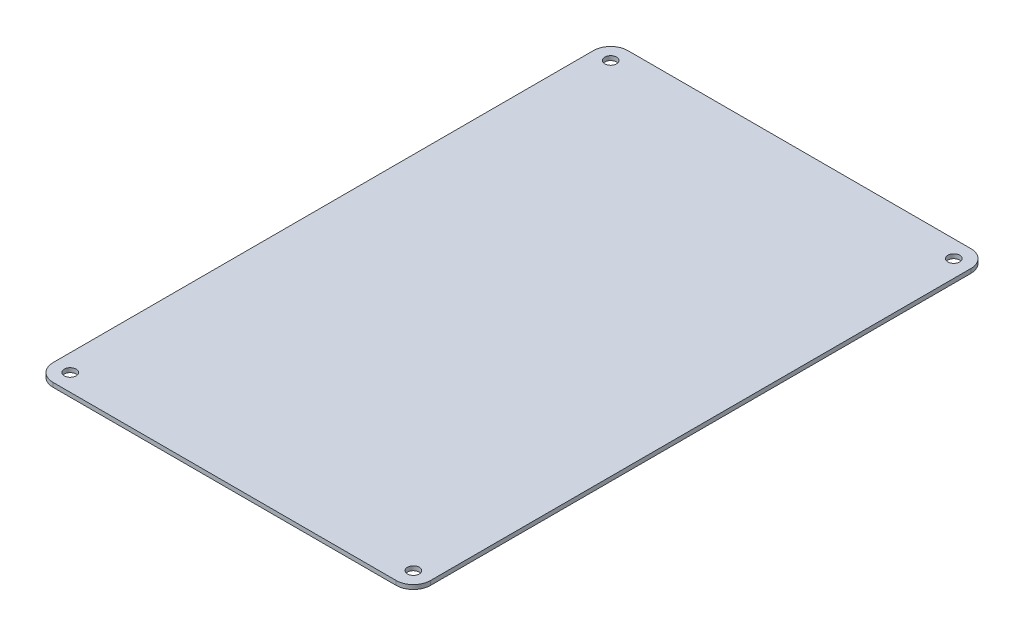
ISO-10303-21;
HEADER;
FILE_DESCRIPTION(('STEP AP214'),'2;1');
FILE_NAME('part.step','',(''),(''),'','','');
FILE_SCHEMA(('AUTOMOTIVE_DESIGN { 1 0 10303 214 1 1 1 1 }'));
ENDSEC;
DATA;
#1=APPLICATION_CONTEXT('core data for automotive mechanical design processes');
#2=APPLICATION_PROTOCOL_DEFINITION('international standard','automotive_design',2000,#1);
#3=PRODUCT_CONTEXT('',#1,'mechanical');
#4=PRODUCT('Part','Part','',(#3));
#5=PRODUCT_RELATED_PRODUCT_CATEGORY('part','',(#4));
#6=PRODUCT_DEFINITION_FORMATION('','',#4);
#7=PRODUCT_DEFINITION_CONTEXT('part definition',#1,'design');
#8=PRODUCT_DEFINITION('design','',#6,#7);
#9=PRODUCT_DEFINITION_SHAPE('','',#8);
#10=(LENGTH_UNIT() NAMED_UNIT(*) SI_UNIT(.MILLI.,.METRE.));
#11=(NAMED_UNIT(*) PLANE_ANGLE_UNIT() SI_UNIT($,.RADIAN.));
#12=(NAMED_UNIT(*) SI_UNIT($,.STERADIAN.) SOLID_ANGLE_UNIT());
#13=UNCERTAINTY_MEASURE_WITH_UNIT(LENGTH_MEASURE(1.E-05),#10,'distance_accuracy_value','');
#14=(GEOMETRIC_REPRESENTATION_CONTEXT(3) GLOBAL_UNCERTAINTY_ASSIGNED_CONTEXT((#13)) GLOBAL_UNIT_ASSIGNED_CONTEXT((#10,
#11,#12)) REPRESENTATION_CONTEXT('',''));
#15=CARTESIAN_POINT('',(0.,0.,0.));
#16=DIRECTION('',(0.,0.,1.));
#17=DIRECTION('',(1.,0.,0.));
#18=AXIS2_PLACEMENT_3D('',#15,#16,#17);
#19=CARTESIAN_POINT('',(6.35,0.79375,-6.35));
#20=DIRECTION('',(0.,-1.,0.));
#21=DIRECTION('',(0.,0.,-1.));
#22=AXIS2_PLACEMENT_3D('',#19,#20,#21);
#23=PLANE('',#22);
#24=CARTESIAN_POINT('',(6.35,0.79375,-6.35));
#25=DIRECTION('',(0.,1.,0.));
#26=DIRECTION('',(0.,0.,-1.));
#27=AXIS2_PLACEMENT_3D('',#24,#25,#26);
#28=CIRCLE('',#27,6.35);
#29=CARTESIAN_POINT('',(0.,0.79375,-6.35000000000004));
#30=VERTEX_POINT('',#29);
#31=CARTESIAN_POINT('',(6.35000000000004,0.79375,0.));
#32=VERTEX_POINT('',#31);
#33=EDGE_CURVE('E166',#30,#32,#28,.T.);
#34=ORIENTED_EDGE('',*,*,#33,.T.);
#35=DIRECTION('',(1.,0.,0.));
#36=VECTOR('',#35,1.);
#37=CARTESIAN_POINT('',(6.35000000000004,0.79375,0.));
#38=LINE('',#37,#36);
#39=CARTESIAN_POINT('',(133.35,0.79375,0.));
#40=VERTEX_POINT('',#39);
#41=EDGE_CURVE('E102',#32,#40,#38,.T.);
#42=ORIENTED_EDGE('',*,*,#41,.T.);
#43=CARTESIAN_POINT('',(133.35,0.79375,-6.35));
#44=DIRECTION('',(0.,1.,0.));
#45=DIRECTION('',(0.,0.,1.));
#46=AXIS2_PLACEMENT_3D('',#43,#44,#45);
#47=CIRCLE('',#46,6.35);
#48=CARTESIAN_POINT('',(139.7,0.79375,-6.35000000000004));
#49=VERTEX_POINT('',#48);
#50=EDGE_CURVE('E187',#40,#49,#47,.T.);
#51=ORIENTED_EDGE('',*,*,#50,.T.);
#52=DIRECTION('',(0.,0.,-1.));
#53=VECTOR('',#52,1.);
#54=CARTESIAN_POINT('',(139.7,0.79375,-6.35000000000004));
#55=LINE('',#54,#53);
#56=CARTESIAN_POINT('',(139.7,0.79375,-206.375));
#57=VERTEX_POINT('',#56);
#58=EDGE_CURVE('E201',#49,#57,#55,.T.);
#59=ORIENTED_EDGE('',*,*,#58,.T.);
#60=CARTESIAN_POINT('',(133.35,0.79375,-206.375));
#61=DIRECTION('',(0.,1.,0.));
#62=DIRECTION('',(0.,0.,1.));
#63=AXIS2_PLACEMENT_3D('',#60,#61,#62);
#64=CIRCLE('',#63,6.34999999999999);
#65=CARTESIAN_POINT('',(133.35,0.79375,-212.725));
#66=VERTEX_POINT('',#65);
#67=EDGE_CURVE('E121',#57,#66,#64,.T.);
#68=ORIENTED_EDGE('',*,*,#67,.T.);
#69=DIRECTION('',(-1.,0.,0.));
#70=VECTOR('',#69,1.);
#71=CARTESIAN_POINT('',(6.35000000000004,0.79375,-212.725));
#72=LINE('',#71,#70);
#73=CARTESIAN_POINT('',(6.35000000000004,0.79375,-212.725));
#74=VERTEX_POINT('',#73);
#75=EDGE_CURVE('E115',#66,#74,#72,.T.);
#76=ORIENTED_EDGE('',*,*,#75,.T.);
#77=CARTESIAN_POINT('',(6.35,0.79375,-206.375));
#78=DIRECTION('',(0.,1.,0.));
#79=DIRECTION('',(0.,0.,1.));
#80=AXIS2_PLACEMENT_3D('',#77,#78,#79);
#81=CIRCLE('',#80,6.35);
#82=CARTESIAN_POINT('',(0.,0.79375,-206.375));
#83=VERTEX_POINT('',#82);
#84=EDGE_CURVE('E119',#74,#83,#81,.T.);
#85=ORIENTED_EDGE('',*,*,#84,.T.);
#86=DIRECTION('',(0.,0.,1.));
#87=VECTOR('',#86,1.);
#88=CARTESIAN_POINT('',(0.,0.79375,-6.35000000000004));
#89=LINE('',#88,#87);
#90=EDGE_CURVE('E59',#83,#30,#89,.T.);
#91=ORIENTED_EDGE('',*,*,#90,.T.);
#92=EDGE_LOOP('',(#34,#42,#51,#59,#68,#76,#85,#91));
#93=FACE_BOUND('',#92,.T.);
#94=CARTESIAN_POINT('',(6.35,0.79375,-206.375));
#95=DIRECTION('',(0.,1.,0.));
#96=DIRECTION('',(0.,0.,1.));
#97=AXIS2_PLACEMENT_3D('',#94,#95,#96);
#98=CIRCLE('',#97,2.1828125);
#99=CARTESIAN_POINT('',(6.35,0.79375,-204.1921875));
#100=VERTEX_POINT('',#99);
#101=EDGE_CURVE('E148',#100,#100,#98,.T.);
#102=ORIENTED_EDGE('',*,*,#101,.F.);
#103=EDGE_LOOP('',(#102));
#104=FACE_BOUND('',#103,.T.);
#105=CARTESIAN_POINT('',(133.35,0.79375,-206.375));
#106=DIRECTION('',(0.,1.,0.));
#107=DIRECTION('',(0.,0.,1.));
#108=AXIS2_PLACEMENT_3D('',#105,#106,#107);
#109=CIRCLE('',#108,2.1828125);
#110=CARTESIAN_POINT('',(133.35,0.79375,-204.1921875));
#111=VERTEX_POINT('',#110);
#112=EDGE_CURVE('E215',#111,#111,#109,.T.);
#113=ORIENTED_EDGE('',*,*,#112,.F.);
#114=EDGE_LOOP('',(#113));
#115=FACE_BOUND('',#114,.T.);
#116=CARTESIAN_POINT('',(6.35,0.79375,-6.35));
#117=DIRECTION('',(0.,1.,0.));
#118=DIRECTION('',(0.,0.,1.));
#119=AXIS2_PLACEMENT_3D('',#116,#117,#118);
#120=CIRCLE('',#119,2.1828125);
#121=CARTESIAN_POINT('',(6.35,0.79375,-4.1671875));
#122=VERTEX_POINT('',#121);
#123=EDGE_CURVE('E223',#122,#122,#120,.T.);
#124=ORIENTED_EDGE('',*,*,#123,.F.);
#125=EDGE_LOOP('',(#124));
#126=FACE_BOUND('',#125,.T.);
#127=CARTESIAN_POINT('',(133.35,0.79375,-6.35));
#128=DIRECTION('',(0.,1.,0.));
#129=DIRECTION('',(0.,0.,1.));
#130=AXIS2_PLACEMENT_3D('',#127,#128,#129);
#131=CIRCLE('',#130,2.1828125);
#132=CARTESIAN_POINT('',(133.35,0.79375,-4.1671875));
#133=VERTEX_POINT('',#132);
#134=EDGE_CURVE('E231',#133,#133,#131,.T.);
#135=ORIENTED_EDGE('',*,*,#134,.F.);
#136=EDGE_LOOP('',(#135));
#137=FACE_BOUND('',#136,.T.);
#138=ADVANCED_FACE('F41',(#93,#104,#115,#126,#137),#23,.F.);
#139=CARTESIAN_POINT('',(6.35,-0.79375,-6.35));
#140=DIRECTION('',(0.,-1.,0.));
#141=DIRECTION('',(0.,0.,-1.));
#142=AXIS2_PLACEMENT_3D('',#139,#140,#141);
#143=PLANE('',#142);
#144=CARTESIAN_POINT('',(6.35,-0.79375,-6.35));
#145=DIRECTION('',(0.,1.,0.));
#146=DIRECTION('',(0.,0.,1.));
#147=AXIS2_PLACEMENT_3D('',#144,#145,#146);
#148=CIRCLE('',#147,2.1828125);
#149=CARTESIAN_POINT('',(6.35,-0.79375,-4.1671875));
#150=VERTEX_POINT('',#149);
#151=EDGE_CURVE('E227',#150,#150,#148,.T.);
#152=ORIENTED_EDGE('',*,*,#151,.T.);
#153=EDGE_LOOP('',(#152));
#154=FACE_BOUND('',#153,.T.);
#155=CARTESIAN_POINT('',(6.35,-0.79375,-206.375));
#156=DIRECTION('',(0.,1.,0.));
#157=DIRECTION('',(0.,0.,1.));
#158=AXIS2_PLACEMENT_3D('',#155,#156,#157);
#159=CIRCLE('',#158,2.1828125);
#160=CARTESIAN_POINT('',(6.35,-0.79375,-204.1921875));
#161=VERTEX_POINT('',#160);
#162=EDGE_CURVE('E211',#161,#161,#159,.T.);
#163=ORIENTED_EDGE('',*,*,#162,.T.);
#164=EDGE_LOOP('',(#163));
#165=FACE_BOUND('',#164,.T.);
#166=CARTESIAN_POINT('',(6.35,-0.79375,-6.35));
#167=DIRECTION('',(0.,1.,0.));
#168=DIRECTION('',(0.,0.,-1.));
#169=AXIS2_PLACEMENT_3D('',#166,#167,#168);
#170=CIRCLE('',#169,6.35);
#171=CARTESIAN_POINT('',(0.,-0.79375,-6.35000000000004));
#172=VERTEX_POINT('',#171);
#173=CARTESIAN_POINT('',(6.35000000000004,-0.79375,0.));
#174=VERTEX_POINT('',#173);
#175=EDGE_CURVE('E143',#172,#174,#170,.T.);
#176=ORIENTED_EDGE('',*,*,#175,.F.);
#177=DIRECTION('',(0.,0.,1.));
#178=VECTOR('',#177,1.);
#179=CARTESIAN_POINT('',(0.,-0.79375,-6.35000000000004));
#180=LINE('',#179,#178);
#181=CARTESIAN_POINT('',(0.,-0.79375,-206.375));
#182=VERTEX_POINT('',#181);
#183=EDGE_CURVE('E94',#182,#172,#180,.T.);
#184=ORIENTED_EDGE('',*,*,#183,.F.);
#185=CARTESIAN_POINT('',(6.35,-0.79375,-206.375));
#186=DIRECTION('',(0.,1.,0.));
#187=DIRECTION('',(0.,0.,1.));
#188=AXIS2_PLACEMENT_3D('',#185,#186,#187);
#189=CIRCLE('',#188,6.35);
#190=CARTESIAN_POINT('',(6.35000000000004,-0.79375,-212.725));
#191=VERTEX_POINT('',#190);
#192=EDGE_CURVE('E88',#191,#182,#189,.T.);
#193=ORIENTED_EDGE('',*,*,#192,.F.);
#194=DIRECTION('',(-1.,0.,0.));
#195=VECTOR('',#194,1.);
#196=CARTESIAN_POINT('',(6.35000000000004,-0.79375,-212.725));
#197=LINE('',#196,#195);
#198=CARTESIAN_POINT('',(133.35,-0.79375,-212.725));
#199=VERTEX_POINT('',#198);
#200=EDGE_CURVE('E130',#199,#191,#197,.T.);
#201=ORIENTED_EDGE('',*,*,#200,.F.);
#202=CARTESIAN_POINT('',(133.35,-0.79375,-206.375));
#203=DIRECTION('',(0.,1.,0.));
#204=DIRECTION('',(0.,0.,1.));
#205=AXIS2_PLACEMENT_3D('',#202,#203,#204);
#206=CIRCLE('',#205,6.34999999999999);
#207=CARTESIAN_POINT('',(139.7,-0.79375,-206.375));
#208=VERTEX_POINT('',#207);
#209=EDGE_CURVE('E157',#208,#199,#206,.T.);
#210=ORIENTED_EDGE('',*,*,#209,.F.);
#211=DIRECTION('',(0.,0.,-1.));
#212=VECTOR('',#211,1.);
#213=CARTESIAN_POINT('',(139.7,-0.79375,-6.35000000000004));
#214=LINE('',#213,#212);
#215=CARTESIAN_POINT('',(139.7,-0.79375,-6.35000000000004));
#216=VERTEX_POINT('',#215);
#217=EDGE_CURVE('E154',#216,#208,#214,.T.);
#218=ORIENTED_EDGE('',*,*,#217,.F.);
#219=CARTESIAN_POINT('',(133.35,-0.79375,-6.35));
#220=DIRECTION('',(0.,1.,0.));
#221=DIRECTION('',(0.,0.,1.));
#222=AXIS2_PLACEMENT_3D('',#219,#220,#221);
#223=CIRCLE('',#222,6.35);
#224=CARTESIAN_POINT('',(133.35,-0.79375,0.));
#225=VERTEX_POINT('',#224);
#226=EDGE_CURVE('E151',#225,#216,#223,.T.);
#227=ORIENTED_EDGE('',*,*,#226,.F.);
#228=DIRECTION('',(1.,0.,0.));
#229=VECTOR('',#228,1.);
#230=CARTESIAN_POINT('',(6.35000000000004,-0.79375,0.));
#231=LINE('',#230,#229);
#232=EDGE_CURVE('E147',#174,#225,#231,.T.);
#233=ORIENTED_EDGE('',*,*,#232,.F.);
#234=EDGE_LOOP('',(#176,#184,#193,#201,#210,#218,#227,#233));
#235=FACE_BOUND('',#234,.T.);
#236=CARTESIAN_POINT('',(133.35,-0.79375,-206.375));
#237=DIRECTION('',(0.,1.,0.));
#238=DIRECTION('',(0.,0.,1.));
#239=AXIS2_PLACEMENT_3D('',#236,#237,#238);
#240=CIRCLE('',#239,2.1828125);
#241=CARTESIAN_POINT('',(133.35,-0.79375,-204.1921875));
#242=VERTEX_POINT('',#241);
#243=EDGE_CURVE('E219',#242,#242,#240,.T.);
#244=ORIENTED_EDGE('',*,*,#243,.T.);
#245=EDGE_LOOP('',(#244));
#246=FACE_BOUND('',#245,.T.);
#247=CARTESIAN_POINT('',(133.35,-0.79375,-6.35));
#248=DIRECTION('',(0.,1.,0.));
#249=DIRECTION('',(0.,0.,1.));
#250=AXIS2_PLACEMENT_3D('',#247,#248,#249);
#251=CIRCLE('',#250,2.1828125);
#252=CARTESIAN_POINT('',(133.35,-0.79375,-4.1671875));
#253=VERTEX_POINT('',#252);
#254=EDGE_CURVE('E235',#253,#253,#251,.T.);
#255=ORIENTED_EDGE('',*,*,#254,.T.);
#256=EDGE_LOOP('',(#255));
#257=FACE_BOUND('',#256,.T.);
#258=ADVANCED_FACE('F191',(#154,#165,#235,#246,#257),#143,.T.);
#259=CARTESIAN_POINT('',(6.35,0.79375,-6.35));
#260=DIRECTION('',(0.,-1.,0.));
#261=DIRECTION('',(0.,0.,-1.));
#262=AXIS2_PLACEMENT_3D('',#259,#260,#261);
#263=CYLINDRICAL_SURFACE('',#262,6.35);
#264=ORIENTED_EDGE('',*,*,#175,.T.);
#265=DIRECTION('',(0.,-1.,0.));
#266=VECTOR('',#265,1.);
#267=CARTESIAN_POINT('',(6.35000000000004,0.79375,0.));
#268=LINE('',#267,#266);
#269=EDGE_CURVE('E11',#32,#174,#268,.T.);
#270=ORIENTED_EDGE('',*,*,#269,.F.);
#271=ORIENTED_EDGE('',*,*,#33,.F.);
#272=DIRECTION('',(0.,-1.,0.));
#273=VECTOR('',#272,1.);
#274=CARTESIAN_POINT('',(0.,0.79375,-6.35000000000004));
#275=LINE('',#274,#273);
#276=EDGE_CURVE('E139',#30,#172,#275,.T.);
#277=ORIENTED_EDGE('',*,*,#276,.T.);
#278=EDGE_LOOP('',(#264,#270,#271,#277));
#279=FACE_BOUND('',#278,.T.);
#280=ADVANCED_FACE('F43',(#279),#263,.T.);
#281=CARTESIAN_POINT('',(6.35000000000004,0.79375,0.));
#282=DIRECTION('',(0.,0.,-1.));
#283=DIRECTION('',(-1.,0.,0.));
#284=AXIS2_PLACEMENT_3D('',#281,#282,#283);
#285=PLANE('',#284);
#286=ORIENTED_EDGE('',*,*,#232,.T.);
#287=DIRECTION('',(0.,-1.,0.));
#288=VECTOR('',#287,1.);
#289=CARTESIAN_POINT('',(133.35,0.79375,0.));
#290=LINE('',#289,#288);
#291=EDGE_CURVE('E51',#40,#225,#290,.T.);
#292=ORIENTED_EDGE('',*,*,#291,.F.);
#293=ORIENTED_EDGE('',*,*,#41,.F.);
#294=ORIENTED_EDGE('',*,*,#269,.T.);
#295=EDGE_LOOP('',(#286,#292,#293,#294));
#296=FACE_BOUND('',#295,.T.);
#297=ADVANCED_FACE('F269',(#296),#285,.F.);
#298=CARTESIAN_POINT('',(133.35,0.79375,-6.35));
#299=DIRECTION('',(0.,-1.,0.));
#300=DIRECTION('',(0.,0.,-1.));
#301=AXIS2_PLACEMENT_3D('',#298,#299,#300);
#302=CYLINDRICAL_SURFACE('',#301,6.35);
#303=ORIENTED_EDGE('',*,*,#226,.T.);
#304=DIRECTION('',(0.,-1.,0.));
#305=VECTOR('',#304,1.);
#306=CARTESIAN_POINT('',(139.7,0.79375,-6.35000000000004));
#307=LINE('',#306,#305);
#308=EDGE_CURVE('E177',#49,#216,#307,.T.);
#309=ORIENTED_EDGE('',*,*,#308,.F.);
#310=ORIENTED_EDGE('',*,*,#50,.F.);
#311=ORIENTED_EDGE('',*,*,#291,.T.);
#312=EDGE_LOOP('',(#303,#309,#310,#311));
#313=FACE_BOUND('',#312,.T.);
#314=ADVANCED_FACE('F185',(#313),#302,.T.);
#315=CARTESIAN_POINT('',(139.7,0.79375,-6.35000000000004));
#316=DIRECTION('',(-1.,0.,0.));
#317=DIRECTION('',(0.,0.,1.));
#318=AXIS2_PLACEMENT_3D('',#315,#316,#317);
#319=PLANE('',#318);
#320=ORIENTED_EDGE('',*,*,#217,.T.);
#321=DIRECTION('',(0.,-1.,0.));
#322=VECTOR('',#321,1.);
#323=CARTESIAN_POINT('',(139.7,0.79375,-206.375));
#324=LINE('',#323,#322);
#325=EDGE_CURVE('E173',#57,#208,#324,.T.);
#326=ORIENTED_EDGE('',*,*,#325,.F.);
#327=ORIENTED_EDGE('',*,*,#58,.F.);
#328=ORIENTED_EDGE('',*,*,#308,.T.);
#329=EDGE_LOOP('',(#320,#326,#327,#328));
#330=FACE_BOUND('',#329,.T.);
#331=ADVANCED_FACE('F196',(#330),#319,.F.);
#332=CARTESIAN_POINT('',(133.35,0.79375,-206.375));
#333=DIRECTION('',(0.,-1.,0.));
#334=DIRECTION('',(0.,0.,-1.));
#335=AXIS2_PLACEMENT_3D('',#332,#333,#334);
#336=CYLINDRICAL_SURFACE('',#335,6.34999999999999);
#337=ORIENTED_EDGE('',*,*,#209,.T.);
#338=DIRECTION('',(0.,-1.,0.));
#339=VECTOR('',#338,1.);
#340=CARTESIAN_POINT('',(133.35,0.79375,-212.725));
#341=LINE('',#340,#339);
#342=EDGE_CURVE('E132',#66,#199,#341,.T.);
#343=ORIENTED_EDGE('',*,*,#342,.F.);
#344=ORIENTED_EDGE('',*,*,#67,.F.);
#345=ORIENTED_EDGE('',*,*,#325,.T.);
#346=EDGE_LOOP('',(#337,#343,#344,#345));
#347=FACE_BOUND('',#346,.T.);
#348=ADVANCED_FACE('F199',(#347),#336,.T.);
#349=CARTESIAN_POINT('',(6.35000000000004,0.79375,-212.725));
#350=DIRECTION('',(0.,0.,1.));
#351=DIRECTION('',(1.,0.,0.));
#352=AXIS2_PLACEMENT_3D('',#349,#350,#351);
#353=PLANE('',#352);
#354=ORIENTED_EDGE('',*,*,#200,.T.);
#355=DIRECTION('',(0.,-1.,0.));
#356=VECTOR('',#355,1.);
#357=CARTESIAN_POINT('',(6.35000000000004,0.79375,-212.725));
#358=LINE('',#357,#356);
#359=EDGE_CURVE('E127',#74,#191,#358,.T.);
#360=ORIENTED_EDGE('',*,*,#359,.F.);
#361=ORIENTED_EDGE('',*,*,#75,.F.);
#362=ORIENTED_EDGE('',*,*,#342,.T.);
#363=EDGE_LOOP('',(#354,#360,#361,#362));
#364=FACE_BOUND('',#363,.T.);
#365=ADVANCED_FACE('F128',(#364),#353,.F.);
#366=CARTESIAN_POINT('',(6.35,0.79375,-206.375));
#367=DIRECTION('',(0.,-1.,0.));
#368=DIRECTION('',(0.,0.,-1.));
#369=AXIS2_PLACEMENT_3D('',#366,#367,#368);
#370=CYLINDRICAL_SURFACE('',#369,6.35);
#371=ORIENTED_EDGE('',*,*,#192,.T.);
#372=DIRECTION('',(0.,-1.,0.));
#373=VECTOR('',#372,1.);
#374=CARTESIAN_POINT('',(0.,0.79375,-206.375));
#375=LINE('',#374,#373);
#376=EDGE_CURVE('E133',#83,#182,#375,.T.);
#377=ORIENTED_EDGE('',*,*,#376,.F.);
#378=ORIENTED_EDGE('',*,*,#84,.F.);
#379=ORIENTED_EDGE('',*,*,#359,.T.);
#380=EDGE_LOOP('',(#371,#377,#378,#379));
#381=FACE_BOUND('',#380,.T.);
#382=ADVANCED_FACE('F135',(#381),#370,.T.);
#383=CARTESIAN_POINT('',(0.,0.79375,-6.35000000000004));
#384=DIRECTION('',(1.,0.,0.));
#385=DIRECTION('',(0.,0.,-1.));
#386=AXIS2_PLACEMENT_3D('',#383,#384,#385);
#387=PLANE('',#386);
#388=ORIENTED_EDGE('',*,*,#183,.T.);
#389=ORIENTED_EDGE('',*,*,#276,.F.);
#390=ORIENTED_EDGE('',*,*,#90,.F.);
#391=ORIENTED_EDGE('',*,*,#376,.T.);
#392=EDGE_LOOP('',(#388,#389,#390,#391));
#393=FACE_BOUND('',#392,.T.);
#394=ADVANCED_FACE('F257',(#393),#387,.F.);
#395=CARTESIAN_POINT('',(6.35,0.79375,-206.375));
#396=DIRECTION('',(0.,-1.,0.));
#397=DIRECTION('',(0.,0.,-1.));
#398=AXIS2_PLACEMENT_3D('',#395,#396,#397);
#399=CYLINDRICAL_SURFACE('',#398,2.1828125);
#400=ORIENTED_EDGE('',*,*,#101,.T.);
#401=EDGE_LOOP('',(#400));
#402=FACE_BOUND('',#401,.T.);
#403=ORIENTED_EDGE('',*,*,#162,.F.);
#404=EDGE_LOOP('',(#403));
#405=FACE_BOUND('',#404,.T.);
#406=ADVANCED_FACE('F254',(#402,#405),#399,.F.);
#407=CARTESIAN_POINT('',(133.35,0.79375,-206.375));
#408=DIRECTION('',(0.,-1.,0.));
#409=DIRECTION('',(0.,0.,-1.));
#410=AXIS2_PLACEMENT_3D('',#407,#408,#409);
#411=CYLINDRICAL_SURFACE('',#410,2.1828125);
#412=ORIENTED_EDGE('',*,*,#112,.T.);
#413=EDGE_LOOP('',(#412));
#414=FACE_BOUND('',#413,.T.);
#415=ORIENTED_EDGE('',*,*,#243,.F.);
#416=EDGE_LOOP('',(#415));
#417=FACE_BOUND('',#416,.T.);
#418=ADVANCED_FACE('F333',(#414,#417),#411,.F.);
#419=CARTESIAN_POINT('',(6.35,0.79375,-6.35));
#420=DIRECTION('',(0.,-1.,0.));
#421=DIRECTION('',(0.,0.,-1.));
#422=AXIS2_PLACEMENT_3D('',#419,#420,#421);
#423=CYLINDRICAL_SURFACE('',#422,2.1828125);
#424=ORIENTED_EDGE('',*,*,#123,.T.);
#425=EDGE_LOOP('',(#424));
#426=FACE_BOUND('',#425,.T.);
#427=ORIENTED_EDGE('',*,*,#151,.F.);
#428=EDGE_LOOP('',(#427));
#429=FACE_BOUND('',#428,.T.);
#430=ADVANCED_FACE('F341',(#426,#429),#423,.F.);
#431=CARTESIAN_POINT('',(133.35,0.79375,-6.35));
#432=DIRECTION('',(0.,-1.,0.));
#433=DIRECTION('',(0.,0.,-1.));
#434=AXIS2_PLACEMENT_3D('',#431,#432,#433);
#435=CYLINDRICAL_SURFACE('',#434,2.1828125);
#436=ORIENTED_EDGE('',*,*,#134,.T.);
#437=EDGE_LOOP('',(#436));
#438=FACE_BOUND('',#437,.T.);
#439=ORIENTED_EDGE('',*,*,#254,.F.);
#440=EDGE_LOOP('',(#439));
#441=FACE_BOUND('',#440,.T.);
#442=ADVANCED_FACE('F243',(#438,#441),#435,.F.);
#443=CLOSED_SHELL('',(#138,#258,#280,#297,#314,#331,#348,#365,#382,#394,#406,#418,#430,#442));
#444=MANIFOLD_SOLID_BREP('B2',#443);
#445=ADVANCED_BREP_SHAPE_REPRESENTATION('',(#18,#444),#14);
#446=SHAPE_DEFINITION_REPRESENTATION(#9,#445);
ENDSEC;
END-ISO-10303-21;
